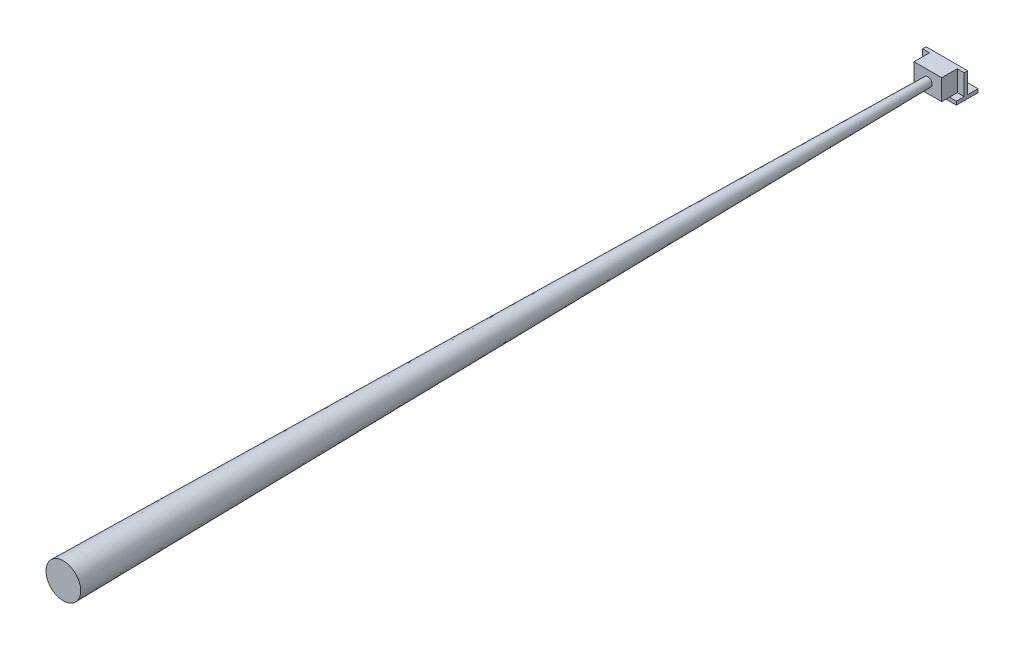
ISO-10303-21;
HEADER;
FILE_DESCRIPTION(('STEP AP214'),'2;1');
FILE_NAME('part.step','',(''),(''),'','','');
FILE_SCHEMA(('AUTOMOTIVE_DESIGN { 1 0 10303 214 1 1 1 1 }'));
ENDSEC;
DATA;
#1=APPLICATION_CONTEXT('core data for automotive mechanical design processes');
#2=APPLICATION_PROTOCOL_DEFINITION('international standard','automotive_design',2000,#1);
#3=PRODUCT_CONTEXT('',#1,'mechanical');
#4=PRODUCT('Part','Part','',(#3));
#5=PRODUCT_RELATED_PRODUCT_CATEGORY('part','',(#4));
#6=PRODUCT_DEFINITION_FORMATION('','',#4);
#7=PRODUCT_DEFINITION_CONTEXT('part definition',#1,'design');
#8=PRODUCT_DEFINITION('design','',#6,#7);
#9=PRODUCT_DEFINITION_SHAPE('','',#8);
#10=(LENGTH_UNIT() NAMED_UNIT(*) SI_UNIT(.MILLI.,.METRE.));
#11=(NAMED_UNIT(*) PLANE_ANGLE_UNIT() SI_UNIT($,.RADIAN.));
#12=(NAMED_UNIT(*) SI_UNIT($,.STERADIAN.) SOLID_ANGLE_UNIT());
#13=UNCERTAINTY_MEASURE_WITH_UNIT(LENGTH_MEASURE(1.E-05),#10,'distance_accuracy_value','');
#14=(GEOMETRIC_REPRESENTATION_CONTEXT(3) GLOBAL_UNCERTAINTY_ASSIGNED_CONTEXT((#13)) GLOBAL_UNIT_ASSIGNED_CONTEXT((#10,
#11,#12)) REPRESENTATION_CONTEXT('',''));
#15=CARTESIAN_POINT('',(0.,0.,0.));
#16=DIRECTION('',(0.,0.,1.));
#17=DIRECTION('',(1.,0.,0.));
#18=AXIS2_PLACEMENT_3D('',#15,#16,#17);
#19=CARTESIAN_POINT('',(0.,16.,21.5));
#20=DIRECTION('',(0.,0.,1.));
#21=DIRECTION('',(0.,-1.,0.));
#22=AXIS2_PLACEMENT_3D('',#19,#20,#21);
#23=PLANE('',#22);
#24=CARTESIAN_POINT('',(0.,16.,21.5000000000001));
#25=DIRECTION('',(0.,0.,1.));
#26=DIRECTION('',(0.,-1.,0.));
#27=AXIS2_PLACEMENT_3D('',#24,#25,#26);
#28=CIRCLE('',#27,5.);
#29=CARTESIAN_POINT('',(0.,11.,21.5000000000001));
#30=VERTEX_POINT('',#29);
#31=EDGE_CURVE('E60',#30,#30,#28,.T.);
#32=ORIENTED_EDGE('',*,*,#31,.F.);
#33=EDGE_LOOP('',(#32));
#34=FACE_BOUND('',#33,.T.);
#35=ADVANCED_FACE('F53',(#34),#23,.F.);
#36=CARTESIAN_POINT('',(0.,36.073982115305,1021.5));
#37=DIRECTION('',(0.,0.,-1.));
#38=DIRECTION('',(0.,1.,0.));
#39=AXIS2_PLACEMENT_3D('',#36,#37,#38);
#40=PLANE('',#39);
#41=CARTESIAN_POINT('',(0.,16.,1021.5));
#42=DIRECTION('',(0.,0.,1.));
#43=DIRECTION('',(0.,-1.,0.));
#44=AXIS2_PLACEMENT_3D('',#41,#42,#43);
#45=CIRCLE('',#44,20.073982115305);
#46=CARTESIAN_POINT('',(0.,-4.07398211530503,1021.5));
#47=VERTEX_POINT('',#46);
#48=EDGE_CURVE('E11',#47,#47,#45,.T.);
#49=ORIENTED_EDGE('',*,*,#48,.T.);
#50=EDGE_LOOP('',(#49));
#51=FACE_BOUND('',#50,.T.);
#52=ADVANCED_FACE('F70',(#51),#40,.F.);
#53=CARTESIAN_POINT('',(0.,16.,21.5000000000001));
#54=DIRECTION('',(0.,0.,1.));
#55=DIRECTION('',(0.,-1.,0.));
#56=AXIS2_PLACEMENT_3D('',#53,#54,#55);
#57=CONICAL_SURFACE('',#56,5.,0.015072840542726);
#58=ORIENTED_EDGE('',*,*,#48,.F.);
#59=EDGE_LOOP('',(#58));
#60=FACE_BOUND('',#59,.T.);
#61=ORIENTED_EDGE('',*,*,#31,.T.);
#62=EDGE_LOOP('',(#61));
#63=FACE_BOUND('',#62,.T.);
#64=ADVANCED_FACE('F67',(#60,#63),#57,.T.);
#65=CLOSED_SHELL('',(#35,#52,#64));
#66=MANIFOLD_SOLID_BREP('B2',#65);
#67=CARTESIAN_POINT('',(0.,4.,0.));
#68=DIRECTION('',(0.,-1.,0.));
#69=DIRECTION('',(0.,0.,-1.));
#70=AXIS2_PLACEMENT_3D('',#67,#68,#69);
#71=PLANE('',#70);
#72=CARTESIAN_POINT('',(0.,4.,-7.5));
#73=DIRECTION('',(0.,1.,0.));
#74=DIRECTION('',(0.,0.,1.));
#75=AXIS2_PLACEMENT_3D('',#72,#73,#74);
#76=CIRCLE('',#75,1.6);
#77=CARTESIAN_POINT('',(0.,4.,-5.9));
#78=VERTEX_POINT('',#77);
#79=EDGE_CURVE('E296',#78,#78,#76,.T.);
#80=ORIENTED_EDGE('',*,*,#79,.F.);
#81=EDGE_LOOP('',(#80));
#82=FACE_BOUND('',#81,.T.);
#83=CARTESIAN_POINT('',(10.,4.,-7.5));
#84=DIRECTION('',(0.,1.,0.));
#85=DIRECTION('',(0.,0.,1.));
#86=AXIS2_PLACEMENT_3D('',#83,#84,#85);
#87=CIRCLE('',#86,1.6);
#88=CARTESIAN_POINT('',(10.,4.,-5.9));
#89=VERTEX_POINT('',#88);
#90=EDGE_CURVE('E305',#89,#89,#87,.F.);
#91=ORIENTED_EDGE('',*,*,#90,.T.);
#92=EDGE_LOOP('',(#91));
#93=FACE_BOUND('',#92,.T.);
#94=DIRECTION('',(0.,0.,1.));
#95=VECTOR('',#94,1.);
#96=CARTESIAN_POINT('',(-24.,4.,12.5));
#97=LINE('',#96,#95);
#98=CARTESIAN_POINT('',(-24.,4.,-12.5));
#99=VERTEX_POINT('',#98);
#100=CARTESIAN_POINT('',(-24.,4.,-0.499999999999997));
#101=VERTEX_POINT('',#100);
#102=EDGE_CURVE('E236',#99,#101,#97,.T.);
#103=ORIENTED_EDGE('',*,*,#102,.T.);
#104=DIRECTION('',(1.,0.,0.));
#105=VECTOR('',#104,1.);
#106=CARTESIAN_POINT('',(0.,4.,-0.499999999999997));
#107=LINE('',#106,#105);
#108=CARTESIAN_POINT('',(24.,4.,-0.499999999999997));
#109=VERTEX_POINT('',#108);
#110=EDGE_CURVE('E216',#101,#109,#107,.T.);
#111=ORIENTED_EDGE('',*,*,#110,.T.);
#112=DIRECTION('',(0.,0.,-1.));
#113=VECTOR('',#112,1.);
#114=CARTESIAN_POINT('',(24.,4.,12.5));
#115=LINE('',#114,#113);
#116=CARTESIAN_POINT('',(24.,4.,-12.5));
#117=VERTEX_POINT('',#116);
#118=EDGE_CURVE('E234',#109,#117,#115,.T.);
#119=ORIENTED_EDGE('',*,*,#118,.T.);
#120=DIRECTION('',(-1.,0.,0.));
#121=VECTOR('',#120,1.);
#122=CARTESIAN_POINT('',(-24.,4.,-12.5));
#123=LINE('',#122,#121);
#124=EDGE_CURVE('E233',#117,#99,#123,.T.);
#125=ORIENTED_EDGE('',*,*,#124,.T.);
#126=EDGE_LOOP('',(#103,#111,#119,#125));
#127=FACE_BOUND('',#126,.T.);
#128=CARTESIAN_POINT('',(-10.,4.,-7.5));
#129=DIRECTION('',(0.,1.,0.));
#130=DIRECTION('',(0.,0.,1.));
#131=AXIS2_PLACEMENT_3D('',#128,#129,#130);
#132=CIRCLE('',#131,1.6);
#133=CARTESIAN_POINT('',(-10.,4.,-5.9));
#134=VERTEX_POINT('',#133);
#135=EDGE_CURVE('E288',#134,#134,#132,.T.);
#136=ORIENTED_EDGE('',*,*,#135,.F.);
#137=EDGE_LOOP('',(#136));
#138=FACE_BOUND('',#137,.T.);
#139=ADVANCED_FACE('F101',(#82,#93,#127,#138),#71,.F.);
#140=CARTESIAN_POINT('',(0.,0.,0.));
#141=DIRECTION('',(0.,-1.,0.));
#142=DIRECTION('',(0.,0.,-1.));
#143=AXIS2_PLACEMENT_3D('',#140,#141,#142);
#144=PLANE('',#143);
#145=CARTESIAN_POINT('',(10.,0.,-7.5));
#146=DIRECTION('',(0.,-1.,0.));
#147=DIRECTION('',(0.,0.,-1.));
#148=AXIS2_PLACEMENT_3D('',#145,#146,#147);
#149=CIRCLE('',#148,1.6);
#150=CARTESIAN_POINT('',(10.,0.,-9.1));
#151=VERTEX_POINT('',#150);
#152=EDGE_CURVE('E304',#151,#151,#149,.T.);
#153=ORIENTED_EDGE('',*,*,#152,.F.);
#154=EDGE_LOOP('',(#153));
#155=FACE_BOUND('',#154,.T.);
#156=DIRECTION('',(0.,0.,-1.));
#157=VECTOR('',#156,1.);
#158=CARTESIAN_POINT('',(24.,0.,12.5));
#159=LINE('',#158,#157);
#160=CARTESIAN_POINT('',(24.,0.,12.5));
#161=VERTEX_POINT('',#160);
#162=CARTESIAN_POINT('',(24.,0.,-12.5));
#163=VERTEX_POINT('',#162);
#164=EDGE_CURVE('E222',#161,#163,#159,.T.);
#165=ORIENTED_EDGE('',*,*,#164,.F.);
#166=DIRECTION('',(1.,0.,0.));
#167=VECTOR('',#166,1.);
#168=CARTESIAN_POINT('',(-24.,0.,12.5));
#169=LINE('',#168,#167);
#170=CARTESIAN_POINT('',(-24.,0.,12.5));
#171=VERTEX_POINT('',#170);
#172=EDGE_CURVE('E247',#171,#161,#169,.T.);
#173=ORIENTED_EDGE('',*,*,#172,.F.);
#174=DIRECTION('',(0.,0.,1.));
#175=VECTOR('',#174,1.);
#176=CARTESIAN_POINT('',(-24.,0.,12.5));
#177=LINE('',#176,#175);
#178=CARTESIAN_POINT('',(-24.,0.,-12.5));
#179=VERTEX_POINT('',#178);
#180=EDGE_CURVE('E245',#179,#171,#177,.T.);
#181=ORIENTED_EDGE('',*,*,#180,.F.);
#182=DIRECTION('',(-1.,0.,0.));
#183=VECTOR('',#182,1.);
#184=CARTESIAN_POINT('',(-24.,0.,-12.5));
#185=LINE('',#184,#183);
#186=EDGE_CURVE('E225',#163,#179,#185,.T.);
#187=ORIENTED_EDGE('',*,*,#186,.F.);
#188=EDGE_LOOP('',(#165,#173,#181,#187));
#189=FACE_BOUND('',#188,.T.);
#190=CARTESIAN_POINT('',(0.,0.,-7.5));
#191=DIRECTION('',(0.,-1.,0.));
#192=DIRECTION('',(0.,0.,-1.));
#193=AXIS2_PLACEMENT_3D('',#190,#191,#192);
#194=CIRCLE('',#193,1.6);
#195=CARTESIAN_POINT('',(0.,0.,-9.1));
#196=VERTEX_POINT('',#195);
#197=EDGE_CURVE('E301',#196,#196,#194,.F.);
#198=ORIENTED_EDGE('',*,*,#197,.T.);
#199=EDGE_LOOP('',(#198));
#200=FACE_BOUND('',#199,.T.);
#201=CARTESIAN_POINT('',(-10.,0.,-7.5));
#202=DIRECTION('',(0.,-1.,0.));
#203=DIRECTION('',(0.,0.,-1.));
#204=AXIS2_PLACEMENT_3D('',#201,#202,#203);
#205=CIRCLE('',#204,1.6);
#206=CARTESIAN_POINT('',(-10.,0.,-9.1));
#207=VERTEX_POINT('',#206);
#208=EDGE_CURVE('E291',#207,#207,#205,.F.);
#209=ORIENTED_EDGE('',*,*,#208,.T.);
#210=EDGE_LOOP('',(#209));
#211=FACE_BOUND('',#210,.T.);
#212=ADVANCED_FACE('F262',(#155,#189,#200,#211),#144,.T.);
#213=DIRECTION('',(1.,0.,0.));
#214=VECTOR('',#213,1.);
#215=CARTESIAN_POINT('',(0.,4.,3.5));
#216=LINE('',#215,#214);
#217=CARTESIAN_POINT('',(16.,4.,3.5));
#218=VERTEX_POINT('',#217);
#219=CARTESIAN_POINT('',(24.,4.,3.5));
#220=VERTEX_POINT('',#219);
#221=EDGE_CURVE('E116',#218,#220,#216,.T.);
#222=ORIENTED_EDGE('',*,*,#221,.F.);
#223=DIRECTION('',(0.,0.,1.));
#224=VECTOR('',#223,1.);
#225=CARTESIAN_POINT('',(16.,4.,0.));
#226=LINE('',#225,#224);
#227=CARTESIAN_POINT('',(16.,4.,12.5));
#228=VERTEX_POINT('',#227);
#229=EDGE_CURVE('E121',#218,#228,#226,.T.);
#230=ORIENTED_EDGE('',*,*,#229,.T.);
#231=DIRECTION('',(1.,0.,0.));
#232=VECTOR('',#231,1.);
#233=CARTESIAN_POINT('',(-24.,4.,12.5));
#234=LINE('',#233,#232);
#235=CARTESIAN_POINT('',(24.,4.,12.5));
#236=VERTEX_POINT('',#235);
#237=EDGE_CURVE('E238',#228,#236,#234,.T.);
#238=ORIENTED_EDGE('',*,*,#237,.T.);
#239=EDGE_CURVE('E231',#236,#220,#115,.T.);
#240=ORIENTED_EDGE('',*,*,#239,.T.);
#241=EDGE_LOOP('',(#222,#230,#238,#240));
#242=FACE_BOUND('',#241,.T.);
#243=ADVANCED_FACE('F275',(#242),#71,.F.);
#244=DIRECTION('',(0.,0.,1.));
#245=VECTOR('',#244,1.);
#246=CARTESIAN_POINT('',(-16.,4.,0.));
#247=LINE('',#246,#245);
#248=CARTESIAN_POINT('',(-16.,4.,3.5));
#249=VERTEX_POINT('',#248);
#250=CARTESIAN_POINT('',(-16.,4.,12.5));
#251=VERTEX_POINT('',#250);
#252=EDGE_CURVE('E289',#249,#251,#247,.T.);
#253=ORIENTED_EDGE('',*,*,#252,.F.);
#254=CARTESIAN_POINT('',(-24.,4.,3.5));
#255=VERTEX_POINT('',#254);
#256=EDGE_CURVE('E281',#255,#249,#216,.T.);
#257=ORIENTED_EDGE('',*,*,#256,.F.);
#258=CARTESIAN_POINT('',(-24.,4.,12.5));
#259=VERTEX_POINT('',#258);
#260=EDGE_CURVE('E221',#255,#259,#97,.T.);
#261=ORIENTED_EDGE('',*,*,#260,.T.);
#262=EDGE_CURVE('E239',#259,#251,#234,.T.);
#263=ORIENTED_EDGE('',*,*,#262,.T.);
#264=EDGE_LOOP('',(#253,#257,#261,#263));
#265=FACE_BOUND('',#264,.T.);
#266=ADVANCED_FACE('F348',(#265),#71,.F.);
#267=CARTESIAN_POINT('',(24.,4.,12.5));
#268=DIRECTION('',(-1.,0.,0.));
#269=DIRECTION('',(0.,0.,1.));
#270=AXIS2_PLACEMENT_3D('',#267,#268,#269);
#271=PLANE('',#270);
#272=ORIENTED_EDGE('',*,*,#164,.T.);
#273=DIRECTION('',(0.,-1.,0.));
#274=VECTOR('',#273,1.);
#275=CARTESIAN_POINT('',(24.,4.,-12.5));
#276=LINE('',#275,#274);
#277=EDGE_CURVE('E51',#117,#163,#276,.T.);
#278=ORIENTED_EDGE('',*,*,#277,.F.);
#279=ORIENTED_EDGE('',*,*,#118,.F.);
#280=DIRECTION('',(0.,-1.,0.));
#281=VECTOR('',#280,1.);
#282=CARTESIAN_POINT('',(24.,28.,-0.499999999999997));
#283=LINE('',#282,#281);
#284=CARTESIAN_POINT('',(24.,28.,-0.499999999999997));
#285=VERTEX_POINT('',#284);
#286=EDGE_CURVE('E320',#285,#109,#283,.T.);
#287=ORIENTED_EDGE('',*,*,#286,.F.);
#288=DIRECTION('',(0.,0.,-1.));
#289=VECTOR('',#288,1.);
#290=CARTESIAN_POINT('',(24.,28.,0.));
#291=LINE('',#290,#289);
#292=CARTESIAN_POINT('',(24.,28.,3.5));
#293=VERTEX_POINT('',#292);
#294=EDGE_CURVE('E316',#293,#285,#291,.T.);
#295=ORIENTED_EDGE('',*,*,#294,.F.);
#296=DIRECTION('',(0.,-1.,0.));
#297=VECTOR('',#296,1.);
#298=CARTESIAN_POINT('',(24.,28.,3.5));
#299=LINE('',#298,#297);
#300=EDGE_CURVE('E274',#293,#220,#299,.T.);
#301=ORIENTED_EDGE('',*,*,#300,.T.);
#302=ORIENTED_EDGE('',*,*,#239,.F.);
#303=DIRECTION('',(0.,-1.,0.));
#304=VECTOR('',#303,1.);
#305=CARTESIAN_POINT('',(24.,4.,12.5));
#306=LINE('',#305,#304);
#307=EDGE_CURVE('E241',#236,#161,#306,.T.);
#308=ORIENTED_EDGE('',*,*,#307,.T.);
#309=EDGE_LOOP('',(#272,#278,#279,#287,#295,#301,#302,#308));
#310=FACE_BOUND('',#309,.T.);
#311=ADVANCED_FACE('F103',(#310),#271,.F.);
#312=CARTESIAN_POINT('',(-24.,4.,-12.5));
#313=DIRECTION('',(0.,0.,1.));
#314=DIRECTION('',(1.,0.,0.));
#315=AXIS2_PLACEMENT_3D('',#312,#313,#314);
#316=PLANE('',#315);
#317=ORIENTED_EDGE('',*,*,#186,.T.);
#318=DIRECTION('',(0.,-1.,0.));
#319=VECTOR('',#318,1.);
#320=CARTESIAN_POINT('',(-24.,4.,-12.5));
#321=LINE('',#320,#319);
#322=EDGE_CURVE('E109',#99,#179,#321,.T.);
#323=ORIENTED_EDGE('',*,*,#322,.F.);
#324=ORIENTED_EDGE('',*,*,#124,.F.);
#325=ORIENTED_EDGE('',*,*,#277,.T.);
#326=EDGE_LOOP('',(#317,#323,#324,#325));
#327=FACE_BOUND('',#326,.T.);
#328=ADVANCED_FACE('F357',(#327),#316,.F.);
#329=CARTESIAN_POINT('',(-24.,4.,12.5));
#330=DIRECTION('',(1.,0.,0.));
#331=DIRECTION('',(0.,0.,-1.));
#332=AXIS2_PLACEMENT_3D('',#329,#330,#331);
#333=PLANE('',#332);
#334=ORIENTED_EDGE('',*,*,#180,.T.);
#335=DIRECTION('',(0.,-1.,0.));
#336=VECTOR('',#335,1.);
#337=CARTESIAN_POINT('',(-24.,4.,12.5));
#338=LINE('',#337,#336);
#339=EDGE_CURVE('E251',#259,#171,#338,.T.);
#340=ORIENTED_EDGE('',*,*,#339,.F.);
#341=ORIENTED_EDGE('',*,*,#260,.F.);
#342=DIRECTION('',(0.,-1.,0.));
#343=VECTOR('',#342,1.);
#344=CARTESIAN_POINT('',(-24.,28.,3.5));
#345=LINE('',#344,#343);
#346=CARTESIAN_POINT('',(-24.,28.,3.5));
#347=VERTEX_POINT('',#346);
#348=EDGE_CURVE('E200',#347,#255,#345,.T.);
#349=ORIENTED_EDGE('',*,*,#348,.F.);
#350=DIRECTION('',(0.,0.,1.));
#351=VECTOR('',#350,1.);
#352=CARTESIAN_POINT('',(-24.,28.,0.));
#353=LINE('',#352,#351);
#354=CARTESIAN_POINT('',(-24.,28.,-0.499999999999997));
#355=VERTEX_POINT('',#354);
#356=EDGE_CURVE('E206',#355,#347,#353,.T.);
#357=ORIENTED_EDGE('',*,*,#356,.F.);
#358=DIRECTION('',(0.,-1.,0.));
#359=VECTOR('',#358,1.);
#360=CARTESIAN_POINT('',(-24.,28.,-0.499999999999997));
#361=LINE('',#360,#359);
#362=EDGE_CURVE('E317',#355,#101,#361,.T.);
#363=ORIENTED_EDGE('',*,*,#362,.T.);
#364=ORIENTED_EDGE('',*,*,#102,.F.);
#365=ORIENTED_EDGE('',*,*,#322,.T.);
#366=EDGE_LOOP('',(#334,#340,#341,#349,#357,#363,#364,#365));
#367=FACE_BOUND('',#366,.T.);
#368=ADVANCED_FACE('F219',(#367),#333,.F.);
#369=CARTESIAN_POINT('',(-24.,4.,12.5));
#370=DIRECTION('',(0.,0.,-1.));
#371=DIRECTION('',(-1.,0.,0.));
#372=AXIS2_PLACEMENT_3D('',#369,#370,#371);
#373=PLANE('',#372);
#374=ORIENTED_EDGE('',*,*,#172,.T.);
#375=ORIENTED_EDGE('',*,*,#307,.F.);
#376=ORIENTED_EDGE('',*,*,#237,.F.);
#377=EDGE_CURVE('E242',#251,#228,#234,.T.);
#378=ORIENTED_EDGE('',*,*,#377,.F.);
#379=ORIENTED_EDGE('',*,*,#262,.F.);
#380=ORIENTED_EDGE('',*,*,#339,.T.);
#381=EDGE_LOOP('',(#374,#375,#376,#378,#379,#380));
#382=FACE_BOUND('',#381,.T.);
#383=ADVANCED_FACE('F266',(#382),#373,.F.);
#384=CARTESIAN_POINT('',(0.,4.,0.));
#385=DIRECTION('',(0.,1.,0.));
#386=DIRECTION('',(0.,0.,1.));
#387=AXIS2_PLACEMENT_3D('',#384,#385,#386);
#388=PLANE('',#387);
#389=CARTESIAN_POINT('',(-16.,4.,21.5));
#390=VERTEX_POINT('',#389);
#391=EDGE_CURVE('E287',#251,#390,#247,.T.);
#392=ORIENTED_EDGE('',*,*,#391,.F.);
#393=ORIENTED_EDGE('',*,*,#377,.T.);
#394=CARTESIAN_POINT('',(16.,4.,21.5));
#395=VERTEX_POINT('',#394);
#396=EDGE_CURVE('E283',#228,#395,#226,.T.);
#397=ORIENTED_EDGE('',*,*,#396,.T.);
#398=DIRECTION('',(1.,0.,0.));
#399=VECTOR('',#398,1.);
#400=CARTESIAN_POINT('',(0.,4.,21.5));
#401=LINE('',#400,#399);
#402=EDGE_CURVE('E337',#390,#395,#401,.T.);
#403=ORIENTED_EDGE('',*,*,#402,.F.);
#404=EDGE_LOOP('',(#392,#393,#397,#403));
#405=FACE_BOUND('',#404,.T.);
#406=ADVANCED_FACE('F341',(#405),#388,.F.);
#407=CARTESIAN_POINT('',(0.,28.,3.5));
#408=DIRECTION('',(0.,0.,-1.));
#409=DIRECTION('',(-1.,0.,0.));
#410=AXIS2_PLACEMENT_3D('',#407,#408,#409);
#411=PLANE('',#410);
#412=ORIENTED_EDGE('',*,*,#256,.T.);
#413=DIRECTION('',(0.,-1.,0.));
#414=VECTOR('',#413,1.);
#415=CARTESIAN_POINT('',(-16.,28.,3.5));
#416=LINE('',#415,#414);
#417=CARTESIAN_POINT('',(-16.,28.,3.5));
#418=VERTEX_POINT('',#417);
#419=EDGE_CURVE('E202',#418,#249,#416,.T.);
#420=ORIENTED_EDGE('',*,*,#419,.F.);
#421=DIRECTION('',(1.,0.,0.));
#422=VECTOR('',#421,1.);
#423=CARTESIAN_POINT('',(0.,28.,3.5));
#424=LINE('',#423,#422);
#425=EDGE_CURVE('E195',#347,#418,#424,.T.);
#426=ORIENTED_EDGE('',*,*,#425,.F.);
#427=ORIENTED_EDGE('',*,*,#348,.T.);
#428=EDGE_LOOP('',(#412,#420,#426,#427));
#429=FACE_BOUND('',#428,.T.);
#430=ADVANCED_FACE('F198',(#429),#411,.F.);
#431=CARTESIAN_POINT('',(-16.,28.,0.));
#432=DIRECTION('',(1.,0.,0.));
#433=DIRECTION('',(0.,0.,-1.));
#434=AXIS2_PLACEMENT_3D('',#431,#432,#433);
#435=PLANE('',#434);
#436=ORIENTED_EDGE('',*,*,#252,.T.);
#437=ORIENTED_EDGE('',*,*,#391,.T.);
#438=DIRECTION('',(0.,-1.,0.));
#439=VECTOR('',#438,1.);
#440=CARTESIAN_POINT('',(-16.,28.,21.5));
#441=LINE('',#440,#439);
#442=CARTESIAN_POINT('',(-16.,28.,21.5));
#443=VERTEX_POINT('',#442);
#444=EDGE_CURVE('E227',#443,#390,#441,.T.);
#445=ORIENTED_EDGE('',*,*,#444,.F.);
#446=DIRECTION('',(0.,0.,1.));
#447=VECTOR('',#446,1.);
#448=CARTESIAN_POINT('',(-16.,28.,0.));
#449=LINE('',#448,#447);
#450=EDGE_CURVE('E205',#418,#443,#449,.T.);
#451=ORIENTED_EDGE('',*,*,#450,.F.);
#452=ORIENTED_EDGE('',*,*,#419,.T.);
#453=EDGE_LOOP('',(#436,#437,#445,#451,#452));
#454=FACE_BOUND('',#453,.T.);
#455=ADVANCED_FACE('F346',(#454),#435,.F.);
#456=CARTESIAN_POINT('',(0.,28.,21.5));
#457=DIRECTION('',(0.,0.,-1.));
#458=DIRECTION('',(-1.,0.,0.));
#459=AXIS2_PLACEMENT_3D('',#456,#457,#458);
#460=PLANE('',#459);
#461=ORIENTED_EDGE('',*,*,#402,.T.);
#462=DIRECTION('',(0.,-1.,0.));
#463=VECTOR('',#462,1.);
#464=CARTESIAN_POINT('',(16.,28.,21.5));
#465=LINE('',#464,#463);
#466=CARTESIAN_POINT('',(16.,28.,21.5));
#467=VERTEX_POINT('',#466);
#468=EDGE_CURVE('E327',#467,#395,#465,.T.);
#469=ORIENTED_EDGE('',*,*,#468,.F.);
#470=DIRECTION('',(1.,0.,0.));
#471=VECTOR('',#470,1.);
#472=CARTESIAN_POINT('',(0.,28.,21.5));
#473=LINE('',#472,#471);
#474=EDGE_CURVE('E311',#443,#467,#473,.T.);
#475=ORIENTED_EDGE('',*,*,#474,.F.);
#476=ORIENTED_EDGE('',*,*,#444,.T.);
#477=EDGE_LOOP('',(#461,#469,#475,#476));
#478=FACE_BOUND('',#477,.T.);
#479=ADVANCED_FACE('F335',(#478),#460,.F.);
#480=CARTESIAN_POINT('',(16.,28.,0.));
#481=DIRECTION('',(1.,0.,0.));
#482=DIRECTION('',(0.,0.,-1.));
#483=AXIS2_PLACEMENT_3D('',#480,#481,#482);
#484=PLANE('',#483);
#485=ORIENTED_EDGE('',*,*,#229,.F.);
#486=DIRECTION('',(0.,-1.,0.));
#487=VECTOR('',#486,1.);
#488=CARTESIAN_POINT('',(16.,28.,3.5));
#489=LINE('',#488,#487);
#490=CARTESIAN_POINT('',(16.,28.,3.5));
#491=VERTEX_POINT('',#490);
#492=EDGE_CURVE('E279',#491,#218,#489,.T.);
#493=ORIENTED_EDGE('',*,*,#492,.F.);
#494=DIRECTION('',(0.,0.,1.));
#495=VECTOR('',#494,1.);
#496=CARTESIAN_POINT('',(16.,28.,0.));
#497=LINE('',#496,#495);
#498=EDGE_CURVE('E313',#491,#467,#497,.T.);
#499=ORIENTED_EDGE('',*,*,#498,.T.);
#500=ORIENTED_EDGE('',*,*,#468,.T.);
#501=ORIENTED_EDGE('',*,*,#396,.F.);
#502=EDGE_LOOP('',(#485,#493,#499,#500,#501));
#503=FACE_BOUND('',#502,.T.);
#504=ADVANCED_FACE('F350',(#503),#484,.T.);
#505=ORIENTED_EDGE('',*,*,#221,.T.);
#506=ORIENTED_EDGE('',*,*,#300,.F.);
#507=EDGE_CURVE('E208',#491,#293,#424,.T.);
#508=ORIENTED_EDGE('',*,*,#507,.F.);
#509=ORIENTED_EDGE('',*,*,#492,.T.);
#510=EDGE_LOOP('',(#505,#506,#508,#509));
#511=FACE_BOUND('',#510,.T.);
#512=ADVANCED_FACE('F277',(#511),#411,.F.);
#513=CARTESIAN_POINT('',(0.,28.,-0.499999999999997));
#514=DIRECTION('',(0.,0.,-1.));
#515=DIRECTION('',(-1.,0.,0.));
#516=AXIS2_PLACEMENT_3D('',#513,#514,#515);
#517=PLANE('',#516);
#518=ORIENTED_EDGE('',*,*,#110,.F.);
#519=ORIENTED_EDGE('',*,*,#362,.F.);
#520=DIRECTION('',(1.,0.,0.));
#521=VECTOR('',#520,1.);
#522=CARTESIAN_POINT('',(0.,28.,-0.499999999999997));
#523=LINE('',#522,#521);
#524=EDGE_CURVE('E213',#355,#285,#523,.T.);
#525=ORIENTED_EDGE('',*,*,#524,.T.);
#526=ORIENTED_EDGE('',*,*,#286,.T.);
#527=EDGE_LOOP('',(#518,#519,#525,#526));
#528=FACE_BOUND('',#527,.T.);
#529=ADVANCED_FACE('F354',(#528),#517,.T.);
#530=CARTESIAN_POINT('',(0.,28.,0.));
#531=DIRECTION('',(0.,1.,0.));
#532=DIRECTION('',(0.,0.,1.));
#533=AXIS2_PLACEMENT_3D('',#530,#531,#532);
#534=PLANE('',#533);
#535=ORIENTED_EDGE('',*,*,#356,.T.);
#536=ORIENTED_EDGE('',*,*,#425,.T.);
#537=ORIENTED_EDGE('',*,*,#450,.T.);
#538=ORIENTED_EDGE('',*,*,#474,.T.);
#539=ORIENTED_EDGE('',*,*,#498,.F.);
#540=ORIENTED_EDGE('',*,*,#507,.T.);
#541=ORIENTED_EDGE('',*,*,#294,.T.);
#542=ORIENTED_EDGE('',*,*,#524,.F.);
#543=EDGE_LOOP('',(#535,#536,#537,#538,#539,#540,#541,#542));
#544=FACE_BOUND('',#543,.T.);
#545=ADVANCED_FACE('F211',(#544),#534,.T.);
#546=CARTESIAN_POINT('',(10.,-0.00100000000000013,-7.5));
#547=DIRECTION('',(0.,1.,0.));
#548=DIRECTION('',(0.,0.,1.));
#549=AXIS2_PLACEMENT_3D('',#546,#547,#548);
#550=CYLINDRICAL_SURFACE('',#549,1.6);
#551=ORIENTED_EDGE('',*,*,#152,.T.);
#552=EDGE_LOOP('',(#551));
#553=FACE_BOUND('',#552,.T.);
#554=ORIENTED_EDGE('',*,*,#90,.F.);
#555=EDGE_LOOP('',(#554));
#556=FACE_BOUND('',#555,.T.);
#557=ADVANCED_FACE('F475',(#553,#556),#550,.F.);
#558=CARTESIAN_POINT('',(0.,-0.00100000000000013,-7.5));
#559=DIRECTION('',(0.,1.,0.));
#560=DIRECTION('',(0.,0.,1.));
#561=AXIS2_PLACEMENT_3D('',#558,#559,#560);
#562=CYLINDRICAL_SURFACE('',#561,1.6);
#563=ORIENTED_EDGE('',*,*,#197,.F.);
#564=EDGE_LOOP('',(#563));
#565=FACE_BOUND('',#564,.T.);
#566=ORIENTED_EDGE('',*,*,#79,.T.);
#567=EDGE_LOOP('',(#566));
#568=FACE_BOUND('',#567,.T.);
#569=ADVANCED_FACE('F498',(#565,#568),#562,.F.);
#570=CARTESIAN_POINT('',(-10.,-0.00100000000000013,-7.5));
#571=DIRECTION('',(0.,1.,0.));
#572=DIRECTION('',(0.,0.,1.));
#573=AXIS2_PLACEMENT_3D('',#570,#571,#572);
#574=CYLINDRICAL_SURFACE('',#573,1.6);
#575=ORIENTED_EDGE('',*,*,#208,.F.);
#576=EDGE_LOOP('',(#575));
#577=FACE_BOUND('',#576,.T.);
#578=ORIENTED_EDGE('',*,*,#135,.T.);
#579=EDGE_LOOP('',(#578));
#580=FACE_BOUND('',#579,.T.);
#581=ADVANCED_FACE('F509',(#577,#580),#574,.F.);
#582=CLOSED_SHELL('',(#139,#212,#243,#266,#311,#328,#368,#383,#406,#430,#455,#479,#504,#512,
#529,#545,#557,#569,#581));
#583=MANIFOLD_SOLID_BREP('B6',#582);
#584=ADVANCED_BREP_SHAPE_REPRESENTATION('',(#18,#66,#583),#14);
#585=SHAPE_DEFINITION_REPRESENTATION(#9,#584);
ENDSEC;
END-ISO-10303-21;
